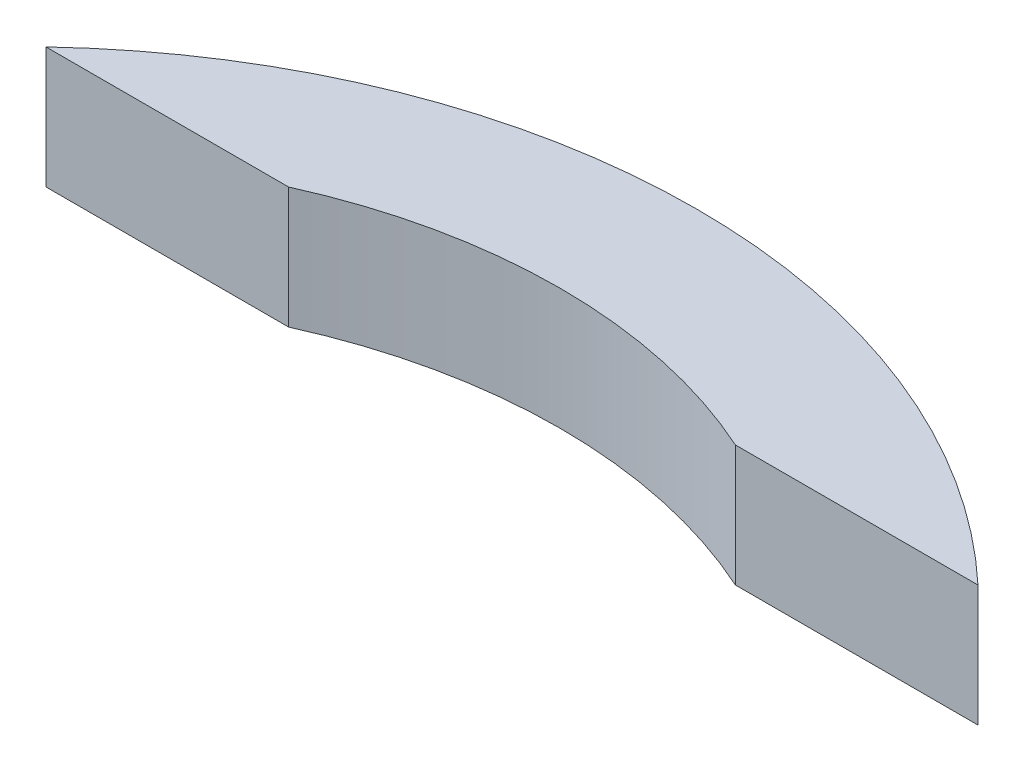
ISO-10303-21;
HEADER;
FILE_DESCRIPTION(('STEP AP214'),'2;1');
FILE_NAME('part.step','',(''),(''),'','','');
FILE_SCHEMA(('AUTOMOTIVE_DESIGN { 1 0 10303 214 1 1 1 1 }'));
ENDSEC;
DATA;
#1=APPLICATION_CONTEXT('core data for automotive mechanical design processes');
#2=APPLICATION_PROTOCOL_DEFINITION('international standard','automotive_design',2000,#1);
#3=PRODUCT_CONTEXT('',#1,'mechanical');
#4=PRODUCT('Part','Part','',(#3));
#5=PRODUCT_RELATED_PRODUCT_CATEGORY('part','',(#4));
#6=PRODUCT_DEFINITION_FORMATION('','',#4);
#7=PRODUCT_DEFINITION_CONTEXT('part definition',#1,'design');
#8=PRODUCT_DEFINITION('design','',#6,#7);
#9=PRODUCT_DEFINITION_SHAPE('','',#8);
#10=(LENGTH_UNIT() NAMED_UNIT(*) SI_UNIT(.MILLI.,.METRE.));
#11=(NAMED_UNIT(*) PLANE_ANGLE_UNIT() SI_UNIT($,.RADIAN.));
#12=(NAMED_UNIT(*) SI_UNIT($,.STERADIAN.) SOLID_ANGLE_UNIT());
#13=UNCERTAINTY_MEASURE_WITH_UNIT(LENGTH_MEASURE(1.E-05),#10,'distance_accuracy_value','');
#14=(GEOMETRIC_REPRESENTATION_CONTEXT(3) GLOBAL_UNCERTAINTY_ASSIGNED_CONTEXT((#13)) GLOBAL_UNIT_ASSIGNED_CONTEXT((#10,
#11,#12)) REPRESENTATION_CONTEXT('',''));
#15=CARTESIAN_POINT('',(0.,0.,0.));
#16=DIRECTION('',(0.,0.,1.));
#17=DIRECTION('',(1.,0.,0.));
#18=AXIS2_PLACEMENT_3D('',#15,#16,#17);
#19=CARTESIAN_POINT('',(162.,40.5,0.));
#20=DIRECTION('',(0.,-1.,0.));
#21=DIRECTION('',(0.,0.,-1.));
#22=AXIS2_PLACEMENT_3D('',#19,#20,#21);
#23=PLANE('',#22);
#24=DIRECTION('',(-1.,0.,0.));
#25=VECTOR('',#24,1.);
#26=CARTESIAN_POINT('',(162.,40.5,0.));
#27=LINE('',#26,#25);
#28=CARTESIAN_POINT('',(622.3,40.5,0.));
#29=VERTEX_POINT('',#28);
#30=CARTESIAN_POINT('',(460.3,40.5,0.));
#31=VERTEX_POINT('',#30);
#32=EDGE_CURVE('E54',#29,#31,#27,.T.);
#33=ORIENTED_EDGE('',*,*,#32,.F.);
#34=CARTESIAN_POINT('',(311.15,40.5,330.184359427633));
#35=DIRECTION('',(0.,-1.,0.));
#36=DIRECTION('',(-0.685818352927377,0.,-0.727772757657209));
#37=AXIS2_PLACEMENT_3D('',#34,#35,#36);
#38=CIRCLE('',#37,453.691562309281);
#39=CARTESIAN_POINT('',(0.,40.5,0.));
#40=VERTEX_POINT('',#39);
#41=EDGE_CURVE('E94',#40,#29,#38,.T.);
#42=ORIENTED_EDGE('',*,*,#41,.F.);
#43=DIRECTION('',(-1.,0.,0.));
#44=VECTOR('',#43,1.);
#45=CARTESIAN_POINT('',(162.,40.5,0.));
#46=LINE('',#45,#44);
#47=CARTESIAN_POINT('',(162.,40.5,0.));
#48=VERTEX_POINT('',#47);
#49=EDGE_CURVE('E104',#48,#40,#46,.T.);
#50=ORIENTED_EDGE('',*,*,#49,.F.);
#51=CARTESIAN_POINT('',(311.15,40.5,330.184359427633));
#52=DIRECTION('',(0.,-1.,0.));
#53=DIRECTION('',(-0.411665773184936,0.,-0.911334895188398));
#54=AXIS2_PLACEMENT_3D('',#51,#52,#53);
#55=CIRCLE('',#54,362.308478662364);
#56=EDGE_CURVE('E98',#48,#31,#55,.T.);
#57=ORIENTED_EDGE('',*,*,#56,.T.);
#58=EDGE_LOOP('',(#33,#42,#50,#57));
#59=FACE_BOUND('',#58,.T.);
#60=ADVANCED_FACE('F40',(#59),#23,.F.);
#61=CARTESIAN_POINT('',(311.15,0.,330.184359427633));
#62=DIRECTION('',(0.,-1.,0.));
#63=DIRECTION('',(0.,0.,-1.));
#64=AXIS2_PLACEMENT_3D('',#61,#62,#63);
#65=CYLINDRICAL_SURFACE('',#64,453.691562309281);
#66=DIRECTION('',(0.,-1.,0.));
#67=VECTOR('',#66,1.);
#68=CARTESIAN_POINT('',(622.3,0.,0.));
#69=LINE('',#68,#67);
#70=CARTESIAN_POINT('',(622.3,-40.5,0.));
#71=VERTEX_POINT('',#70);
#72=EDGE_CURVE('E90',#71,#29,#69,.F.);
#73=ORIENTED_EDGE('',*,*,#72,.F.);
#74=CARTESIAN_POINT('',(311.15,-40.5,330.184359427633));
#75=DIRECTION('',(0.,-1.,0.));
#76=DIRECTION('',(-0.685818352927377,0.,-0.727772757657209));
#77=AXIS2_PLACEMENT_3D('',#74,#75,#76);
#78=CIRCLE('',#77,453.691562309281);
#79=CARTESIAN_POINT('',(0.,-40.5,0.));
#80=VERTEX_POINT('',#79);
#81=EDGE_CURVE('E89',#80,#71,#78,.T.);
#82=ORIENTED_EDGE('',*,*,#81,.F.);
#83=DIRECTION('',(0.,-1.,0.));
#84=VECTOR('',#83,1.);
#85=CARTESIAN_POINT('',(0.,40.5,0.));
#86=LINE('',#85,#84);
#87=EDGE_CURVE('E102',#40,#80,#86,.T.);
#88=ORIENTED_EDGE('',*,*,#87,.F.);
#89=ORIENTED_EDGE('',*,*,#41,.T.);
#90=EDGE_LOOP('',(#73,#82,#88,#89));
#91=FACE_BOUND('',#90,.T.);
#92=ADVANCED_FACE('F114',(#91),#65,.T.);
#93=CARTESIAN_POINT('',(0.,-40.5,0.));
#94=DIRECTION('',(0.,1.,0.));
#95=DIRECTION('',(0.,0.,1.));
#96=AXIS2_PLACEMENT_3D('',#93,#94,#95);
#97=PLANE('',#96);
#98=DIRECTION('',(1.,0.,0.));
#99=VECTOR('',#98,1.);
#100=CARTESIAN_POINT('',(0.,-40.5,0.));
#101=LINE('',#100,#99);
#102=CARTESIAN_POINT('',(460.3,-40.5,0.));
#103=VERTEX_POINT('',#102);
#104=EDGE_CURVE('E81',#103,#71,#101,.T.);
#105=ORIENTED_EDGE('',*,*,#104,.F.);
#106=CARTESIAN_POINT('',(311.15,-40.5,330.184359427633));
#107=DIRECTION('',(0.,-1.,0.));
#108=DIRECTION('',(-0.411665773184936,0.,-0.911334895188398));
#109=AXIS2_PLACEMENT_3D('',#106,#107,#108);
#110=CIRCLE('',#109,362.308478662364);
#111=CARTESIAN_POINT('',(162.,-40.5,0.));
#112=VERTEX_POINT('',#111);
#113=EDGE_CURVE('E48',#112,#103,#110,.T.);
#114=ORIENTED_EDGE('',*,*,#113,.F.);
#115=DIRECTION('',(1.,0.,0.));
#116=VECTOR('',#115,1.);
#117=CARTESIAN_POINT('',(0.,-40.5,0.));
#118=LINE('',#117,#116);
#119=EDGE_CURVE('E97',#80,#112,#118,.T.);
#120=ORIENTED_EDGE('',*,*,#119,.F.);
#121=ORIENTED_EDGE('',*,*,#81,.T.);
#122=EDGE_LOOP('',(#105,#114,#120,#121));
#123=FACE_BOUND('',#122,.T.);
#124=ADVANCED_FACE('F87',(#123),#97,.F.);
#125=CARTESIAN_POINT('',(311.15,0.,330.184359427633));
#126=DIRECTION('',(0.,-1.,0.));
#127=DIRECTION('',(0.,0.,-1.));
#128=AXIS2_PLACEMENT_3D('',#125,#126,#127);
#129=CYLINDRICAL_SURFACE('',#128,362.308478662364);
#130=DIRECTION('',(0.,-1.,0.));
#131=VECTOR('',#130,1.);
#132=CARTESIAN_POINT('',(460.3,0.,0.));
#133=LINE('',#132,#131);
#134=EDGE_CURVE('E11',#31,#103,#133,.T.);
#135=ORIENTED_EDGE('',*,*,#134,.F.);
#136=ORIENTED_EDGE('',*,*,#56,.F.);
#137=DIRECTION('',(0.,1.,0.));
#138=VECTOR('',#137,1.);
#139=CARTESIAN_POINT('',(162.,-40.5,0.));
#140=LINE('',#139,#138);
#141=EDGE_CURVE('E62',#112,#48,#140,.T.);
#142=ORIENTED_EDGE('',*,*,#141,.F.);
#143=ORIENTED_EDGE('',*,*,#113,.T.);
#144=EDGE_LOOP('',(#135,#136,#142,#143));
#145=FACE_BOUND('',#144,.T.);
#146=ADVANCED_FACE('F92',(#145),#129,.F.);
#147=CARTESIAN_POINT('',(0.,0.,0.));
#148=DIRECTION('',(0.,0.,1.));
#149=DIRECTION('',(1.,0.,0.));
#150=AXIS2_PLACEMENT_3D('',#147,#148,#149);
#151=PLANE('',#150);
#152=ORIENTED_EDGE('',*,*,#49,.T.);
#153=ORIENTED_EDGE('',*,*,#87,.T.);
#154=ORIENTED_EDGE('',*,*,#119,.T.);
#155=ORIENTED_EDGE('',*,*,#141,.T.);
#156=EDGE_LOOP('',(#152,#153,#154,#155));
#157=FACE_BOUND('',#156,.T.);
#158=ADVANCED_FACE('F42',(#157),#151,.T.);
#159=CARTESIAN_POINT('',(0.,0.,0.));
#160=DIRECTION('',(0.,0.,1.));
#161=DIRECTION('',(1.,0.,0.));
#162=AXIS2_PLACEMENT_3D('',#159,#160,#161);
#163=PLANE('',#162);
#164=ORIENTED_EDGE('',*,*,#32,.T.);
#165=ORIENTED_EDGE('',*,*,#134,.T.);
#166=ORIENTED_EDGE('',*,*,#104,.T.);
#167=ORIENTED_EDGE('',*,*,#72,.T.);
#168=EDGE_LOOP('',(#164,#165,#166,#167));
#169=FACE_BOUND('',#168,.T.);
#170=ADVANCED_FACE('F80',(#169),#163,.T.);
#171=CLOSED_SHELL('',(#60,#92,#124,#146,#158,#170));
#172=MANIFOLD_SOLID_BREP('B2',#171);
#173=ADVANCED_BREP_SHAPE_REPRESENTATION('',(#18,#172),#14);
#174=SHAPE_DEFINITION_REPRESENTATION(#9,#173);
ENDSEC;
END-ISO-10303-21;
